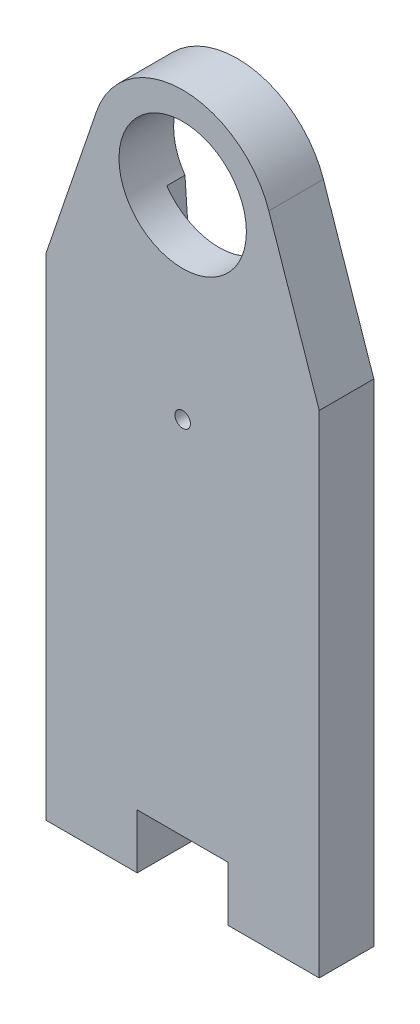
ISO-10303-21;
HEADER;
FILE_DESCRIPTION(('STEP AP214'),'2;1');
FILE_NAME('part.step','',(''),(''),'','','');
FILE_SCHEMA(('AUTOMOTIVE_DESIGN { 1 0 10303 214 1 1 1 1 }'));
ENDSEC;
DATA;
#1=APPLICATION_CONTEXT('core data for automotive mechanical design processes');
#2=APPLICATION_PROTOCOL_DEFINITION('international standard','automotive_design',2000,#1);
#3=PRODUCT_CONTEXT('',#1,'mechanical');
#4=PRODUCT('Part','Part','',(#3));
#5=PRODUCT_RELATED_PRODUCT_CATEGORY('part','',(#4));
#6=PRODUCT_DEFINITION_FORMATION('','',#4);
#7=PRODUCT_DEFINITION_CONTEXT('part definition',#1,'design');
#8=PRODUCT_DEFINITION('design','',#6,#7);
#9=PRODUCT_DEFINITION_SHAPE('','',#8);
#10=(LENGTH_UNIT() NAMED_UNIT(*) SI_UNIT(.MILLI.,.METRE.));
#11=(NAMED_UNIT(*) PLANE_ANGLE_UNIT() SI_UNIT($,.RADIAN.));
#12=(NAMED_UNIT(*) SI_UNIT($,.STERADIAN.) SOLID_ANGLE_UNIT());
#13=UNCERTAINTY_MEASURE_WITH_UNIT(LENGTH_MEASURE(1.E-05),#10,'distance_accuracy_value','');
#14=(GEOMETRIC_REPRESENTATION_CONTEXT(3) GLOBAL_UNCERTAINTY_ASSIGNED_CONTEXT((#13)) GLOBAL_UNIT_ASSIGNED_CONTEXT((#10,
#11,#12)) REPRESENTATION_CONTEXT('',''));
#15=CARTESIAN_POINT('',(0.,0.,0.));
#16=DIRECTION('',(0.,0.,1.));
#17=DIRECTION('',(1.,0.,0.));
#18=AXIS2_PLACEMENT_3D('',#15,#16,#17);
#19=CARTESIAN_POINT('',(42.9999999999916,45.2499999999958,0.));
#20=DIRECTION('',(0.,0.,1.));
#21=DIRECTION('',(1.,0.,0.));
#22=AXIS2_PLACEMENT_3D('',#19,#20,#21);
#23=PLANE('',#22);
#24=CARTESIAN_POINT('',(42.9999999999916,45.2499999999958,0.));
#25=DIRECTION('',(0.,0.,1.));
#26=DIRECTION('',(1.,0.,0.));
#27=AXIS2_PLACEMENT_3D('',#24,#25,#26);
#28=CIRCLE('',#27,5.00000000001832);
#29=CARTESIAN_POINT('',(47.7322787638814,46.8641678044589,0.));
#30=VERTEX_POINT('',#29);
#31=CARTESIAN_POINT('',(38.2677212360993,46.864167804486,0.));
#32=VERTEX_POINT('',#31);
#33=EDGE_CURVE('E155',#30,#32,#28,.T.);
#34=ORIENTED_EDGE('',*,*,#33,.F.);
#35=DIRECTION('',(-0.322833560893029,0.946455752775124,0.));
#36=VECTOR('',#35,1.);
#37=CARTESIAN_POINT('',(47.7322787638814,46.8641678044589,0.));
#38=LINE('',#37,#36);
#39=CARTESIAN_POINT('',(50.4999999999993,38.7499999999858,0.));
#40=VERTEX_POINT('',#39);
#41=EDGE_CURVE('E96',#40,#30,#38,.T.);
#42=ORIENTED_EDGE('',*,*,#41,.F.);
#43=DIRECTION('',(0.,1.,0.));
#44=VECTOR('',#43,1.);
#45=CARTESIAN_POINT('',(50.4999999999993,38.7499999999858,0.));
#46=LINE('',#45,#44);
#47=CARTESIAN_POINT('',(50.4999999999993,11.7499999999859,0.));
#48=VERTEX_POINT('',#47);
#49=EDGE_CURVE('E172',#48,#40,#46,.T.);
#50=ORIENTED_EDGE('',*,*,#49,.F.);
#51=DIRECTION('',(1.,0.,0.));
#52=VECTOR('',#51,1.);
#53=CARTESIAN_POINT('',(50.4999999999993,11.7499999999859,0.));
#54=LINE('',#53,#52);
#55=CARTESIAN_POINT('',(45.4999999999984,11.7499999999858,0.));
#56=VERTEX_POINT('',#55);
#57=EDGE_CURVE('E144',#56,#48,#54,.T.);
#58=ORIENTED_EDGE('',*,*,#57,.F.);
#59=DIRECTION('',(0.,-1.,0.));
#60=VECTOR('',#59,1.);
#61=CARTESIAN_POINT('',(45.4999999999984,11.7499999999858,0.));
#62=LINE('',#61,#60);
#63=CARTESIAN_POINT('',(45.4999999999984,14.7499999999858,0.));
#64=VERTEX_POINT('',#63);
#65=EDGE_CURVE('E169',#64,#56,#62,.T.);
#66=ORIENTED_EDGE('',*,*,#65,.F.);
#67=DIRECTION('',(1.,0.,0.));
#68=VECTOR('',#67,1.);
#69=CARTESIAN_POINT('',(45.4999999999984,14.7499999999858,0.));
#70=LINE('',#69,#68);
#71=CARTESIAN_POINT('',(40.4999999999993,14.7499999999858,0.));
#72=VERTEX_POINT('',#71);
#73=EDGE_CURVE('E167',#72,#64,#70,.T.);
#74=ORIENTED_EDGE('',*,*,#73,.F.);
#75=DIRECTION('',(0.,1.,0.));
#76=VECTOR('',#75,1.);
#77=CARTESIAN_POINT('',(40.4999999999993,14.7499999999858,0.));
#78=LINE('',#77,#76);
#79=CARTESIAN_POINT('',(40.4999999999993,11.7499999999858,0.));
#80=VERTEX_POINT('',#79);
#81=EDGE_CURVE('E165',#80,#72,#78,.T.);
#82=ORIENTED_EDGE('',*,*,#81,.F.);
#83=DIRECTION('',(1.,0.,0.));
#84=VECTOR('',#83,1.);
#85=CARTESIAN_POINT('',(40.4999999999993,11.7499999999858,0.));
#86=LINE('',#85,#84);
#87=CARTESIAN_POINT('',(35.5000000000007,11.7499999999858,0.));
#88=VERTEX_POINT('',#87);
#89=EDGE_CURVE('E163',#88,#80,#86,.T.);
#90=ORIENTED_EDGE('',*,*,#89,.F.);
#91=DIRECTION('',(0.,-1.,0.));
#92=VECTOR('',#91,1.);
#93=CARTESIAN_POINT('',(35.5000000000007,11.7499999999858,0.));
#94=LINE('',#93,#92);
#95=CARTESIAN_POINT('',(35.5000000000007,38.7499999999858,0.));
#96=VERTEX_POINT('',#95);
#97=EDGE_CURVE('E161',#96,#88,#94,.T.);
#98=ORIENTED_EDGE('',*,*,#97,.F.);
#99=DIRECTION('',(-0.322833560890054,-0.946455752776139,0.));
#100=VECTOR('',#99,1.);
#101=CARTESIAN_POINT('',(35.5000000000007,38.7499999999858,0.));
#102=LINE('',#101,#100);
#103=EDGE_CURVE('E158',#32,#96,#102,.T.);
#104=ORIENTED_EDGE('',*,*,#103,.F.);
#105=EDGE_LOOP('',(#34,#42,#50,#58,#66,#74,#82,#90,#98,#104));
#106=FACE_BOUND('',#105,.T.);
#107=DIRECTION('',(0.0694233825828912,-0.997587286381873,0.));
#108=VECTOR('',#107,1.);
#109=CARTESIAN_POINT('',(41.0048254272376,30.611153234821,0.));
#110=LINE('',#109,#108);
#111=CARTESIAN_POINT('',(40.1249999999984,43.2539059759649,0.));
#112=VERTEX_POINT('',#111);
#113=CARTESIAN_POINT('',(41.0048254272376,30.611153234821,0.));
#114=VERTEX_POINT('',#113);
#115=EDGE_CURVE('E251',#112,#114,#110,.T.);
#116=ORIENTED_EDGE('',*,*,#115,.T.);
#117=CARTESIAN_POINT('',(43.0000000000005,30.749999999986,0.));
#118=DIRECTION('',(0.,0.,1.));
#119=DIRECTION('',(1.,0.,0.));
#120=AXIS2_PLACEMENT_3D('',#117,#118,#119);
#121=CIRCLE('',#120,1.99999999999904);
#122=CARTESIAN_POINT('',(44.9951745727633,30.611153234821,0.));
#123=VERTEX_POINT('',#122);
#124=EDGE_CURVE('E248',#114,#123,#121,.T.);
#125=ORIENTED_EDGE('',*,*,#124,.T.);
#126=DIRECTION('',(0.0694233825828588,0.997587286381876,0.));
#127=VECTOR('',#126,1.);
#128=CARTESIAN_POINT('',(45.8750000000033,43.2539059759825,0.));
#129=LINE('',#128,#127);
#130=CARTESIAN_POINT('',(45.8750000000033,43.2539059759825,0.));
#131=VERTEX_POINT('',#130);
#132=EDGE_CURVE('E244',#123,#131,#129,.T.);
#133=ORIENTED_EDGE('',*,*,#132,.T.);
#134=CARTESIAN_POINT('',(42.9999999999916,45.2499999999958,0.));
#135=DIRECTION('',(0.,0.,1.));
#136=DIRECTION('',(1.,0.,0.));
#137=AXIS2_PLACEMENT_3D('',#134,#135,#136);
#138=CIRCLE('',#137,3.50000233610408);
#139=EDGE_CURVE('E225',#131,#112,#138,.T.);
#140=ORIENTED_EDGE('',*,*,#139,.T.);
#141=EDGE_LOOP('',(#116,#125,#133,#140));
#142=FACE_BOUND('',#141,.T.);
#143=ADVANCED_FACE('F33',(#106,#142),#23,.F.);
#144=CARTESIAN_POINT('',(42.9999999999916,45.2499999999958,3.));
#145=DIRECTION('',(0.,0.,-1.));
#146=DIRECTION('',(-1.,0.,0.));
#147=AXIS2_PLACEMENT_3D('',#144,#145,#146);
#148=CYLINDRICAL_SURFACE('',#147,3.50000233610408);
#149=CARTESIAN_POINT('',(42.9999999999916,45.2499999999958,3.));
#150=DIRECTION('',(0.,0.,1.));
#151=DIRECTION('',(1.,0.,0.));
#152=AXIS2_PLACEMENT_3D('',#149,#150,#151);
#153=CIRCLE('',#152,3.50000233610408);
#154=CARTESIAN_POINT('',(46.5000023360957,45.2499999999958,3.));
#155=VERTEX_POINT('',#154);
#156=EDGE_CURVE('E224',#155,#155,#153,.T.);
#157=ORIENTED_EDGE('',*,*,#156,.T.);
#158=EDGE_LOOP('',(#157));
#159=FACE_BOUND('',#158,.T.);
#160=CARTESIAN_POINT('',(42.9999999999948,45.2499999999957,1.));
#161=DIRECTION('',(0.,0.,-1.));
#162=DIRECTION('',(1.,0.,0.));
#163=AXIS2_PLACEMENT_3D('',#160,#161,#162);
#164=CIRCLE('',#163,3.50000233610638);
#165=CARTESIAN_POINT('',(45.8750000000033,43.2539059759825,1.));
#166=VERTEX_POINT('',#165);
#167=CARTESIAN_POINT('',(40.1249999999983,43.2539059759648,1.));
#168=VERTEX_POINT('',#167);
#169=EDGE_CURVE('E247',#166,#168,#164,.T.);
#170=ORIENTED_EDGE('',*,*,#169,.T.);
#171=DIRECTION('',(0.,0.,-1.));
#172=VECTOR('',#171,1.);
#173=CARTESIAN_POINT('',(40.1249999999984,43.2539059759649,1.));
#174=LINE('',#173,#172);
#175=EDGE_CURVE('E48',#168,#112,#174,.T.);
#176=ORIENTED_EDGE('',*,*,#175,.T.);
#177=ORIENTED_EDGE('',*,*,#139,.F.);
#178=DIRECTION('',(0.,0.,-1.));
#179=VECTOR('',#178,1.);
#180=CARTESIAN_POINT('',(45.8750000000033,43.2539059759825,1.));
#181=LINE('',#180,#179);
#182=EDGE_CURVE('E240',#166,#131,#181,.T.);
#183=ORIENTED_EDGE('',*,*,#182,.F.);
#184=EDGE_LOOP('',(#170,#176,#177,#183));
#185=FACE_BOUND('',#184,.T.);
#186=ADVANCED_FACE('F265',(#159,#185),#148,.F.);
#187=CARTESIAN_POINT('',(42.9999999999916,45.2499999999958,3.));
#188=DIRECTION('',(0.,0.,1.));
#189=DIRECTION('',(1.,0.,0.));
#190=AXIS2_PLACEMENT_3D('',#187,#188,#189);
#191=PLANE('',#190);
#192=CARTESIAN_POINT('',(42.9999999999993,34.5777705464858,3.));
#193=DIRECTION('',(0.,0.,1.));
#194=DIRECTION('',(1.,0.,0.));
#195=AXIS2_PLACEMENT_3D('',#192,#193,#194);
#196=CIRCLE('',#195,0.425000000000002);
#197=CARTESIAN_POINT('',(43.4249999999993,34.5777705464858,3.));
#198=VERTEX_POINT('',#197);
#199=EDGE_CURVE('E159',#198,#198,#196,.T.);
#200=ORIENTED_EDGE('',*,*,#199,.F.);
#201=EDGE_LOOP('',(#200));
#202=FACE_BOUND('',#201,.T.);
#203=CARTESIAN_POINT('',(42.9999999999916,45.2499999999958,3.));
#204=DIRECTION('',(0.,0.,1.));
#205=DIRECTION('',(1.,0.,0.));
#206=AXIS2_PLACEMENT_3D('',#203,#204,#205);
#207=CIRCLE('',#206,5.00000000001832);
#208=CARTESIAN_POINT('',(47.7322787638814,46.8641678044589,3.));
#209=VERTEX_POINT('',#208);
#210=CARTESIAN_POINT('',(38.2677212360993,46.864167804486,3.));
#211=VERTEX_POINT('',#210);
#212=EDGE_CURVE('E175',#209,#211,#207,.T.);
#213=ORIENTED_EDGE('',*,*,#212,.T.);
#214=DIRECTION('',(-0.322833560890054,-0.946455752776139,0.));
#215=VECTOR('',#214,1.);
#216=CARTESIAN_POINT('',(35.5000000000007,38.7499999999858,3.));
#217=LINE('',#216,#215);
#218=CARTESIAN_POINT('',(35.5000000000007,38.7499999999858,3.));
#219=VERTEX_POINT('',#218);
#220=EDGE_CURVE('E104',#211,#219,#217,.T.);
#221=ORIENTED_EDGE('',*,*,#220,.T.);
#222=DIRECTION('',(0.,-1.,0.));
#223=VECTOR('',#222,1.);
#224=CARTESIAN_POINT('',(35.5000000000007,11.7499999999858,3.));
#225=LINE('',#224,#223);
#226=CARTESIAN_POINT('',(35.5000000000007,11.7499999999858,3.));
#227=VERTEX_POINT('',#226);
#228=EDGE_CURVE('E196',#219,#227,#225,.T.);
#229=ORIENTED_EDGE('',*,*,#228,.T.);
#230=DIRECTION('',(1.,0.,0.));
#231=VECTOR('',#230,1.);
#232=CARTESIAN_POINT('',(40.4999999999993,11.7499999999858,3.));
#233=LINE('',#232,#231);
#234=CARTESIAN_POINT('',(40.4999999999993,11.7499999999858,3.));
#235=VERTEX_POINT('',#234);
#236=EDGE_CURVE('E214',#227,#235,#233,.T.);
#237=ORIENTED_EDGE('',*,*,#236,.T.);
#238=DIRECTION('',(0.,1.,0.));
#239=VECTOR('',#238,1.);
#240=CARTESIAN_POINT('',(40.4999999999993,14.7499999999858,3.));
#241=LINE('',#240,#239);
#242=CARTESIAN_POINT('',(40.4999999999993,14.7499999999858,3.));
#243=VERTEX_POINT('',#242);
#244=EDGE_CURVE('E211',#235,#243,#241,.T.);
#245=ORIENTED_EDGE('',*,*,#244,.T.);
#246=DIRECTION('',(1.,0.,0.));
#247=VECTOR('',#246,1.);
#248=CARTESIAN_POINT('',(45.4999999999984,14.7499999999858,3.));
#249=LINE('',#248,#247);
#250=CARTESIAN_POINT('',(45.4999999999984,14.7499999999858,3.));
#251=VERTEX_POINT('',#250);
#252=EDGE_CURVE('E213',#243,#251,#249,.T.);
#253=ORIENTED_EDGE('',*,*,#252,.T.);
#254=DIRECTION('',(0.,-1.,0.));
#255=VECTOR('',#254,1.);
#256=CARTESIAN_POINT('',(45.4999999999984,11.7499999999858,3.));
#257=LINE('',#256,#255);
#258=CARTESIAN_POINT('',(45.4999999999984,11.7499999999858,3.));
#259=VERTEX_POINT('',#258);
#260=EDGE_CURVE('E134',#251,#259,#257,.T.);
#261=ORIENTED_EDGE('',*,*,#260,.T.);
#262=DIRECTION('',(1.,0.,0.));
#263=VECTOR('',#262,1.);
#264=CARTESIAN_POINT('',(50.4999999999993,11.7499999999859,3.));
#265=LINE('',#264,#263);
#266=CARTESIAN_POINT('',(50.4999999999993,11.7499999999859,3.));
#267=VERTEX_POINT('',#266);
#268=EDGE_CURVE('E126',#259,#267,#265,.T.);
#269=ORIENTED_EDGE('',*,*,#268,.T.);
#270=DIRECTION('',(0.,1.,0.));
#271=VECTOR('',#270,1.);
#272=CARTESIAN_POINT('',(50.4999999999993,24.7499999999859,3.));
#273=LINE('',#272,#271);
#274=CARTESIAN_POINT('',(50.4999999999993,38.7499999999858,3.));
#275=VERTEX_POINT('',#274);
#276=EDGE_CURVE('E131',#267,#275,#273,.T.);
#277=ORIENTED_EDGE('',*,*,#276,.T.);
#278=DIRECTION('',(-0.322833560893029,0.946455752775124,0.));
#279=VECTOR('',#278,1.);
#280=CARTESIAN_POINT('',(47.7322787638814,46.8641678044589,3.));
#281=LINE('',#280,#279);
#282=EDGE_CURVE('E57',#275,#209,#281,.T.);
#283=ORIENTED_EDGE('',*,*,#282,.T.);
#284=EDGE_LOOP('',(#213,#221,#229,#237,#245,#253,#261,#269,#277,#283));
#285=FACE_BOUND('',#284,.T.);
#286=ORIENTED_EDGE('',*,*,#156,.F.);
#287=EDGE_LOOP('',(#286));
#288=FACE_BOUND('',#287,.T.);
#289=ADVANCED_FACE('F128',(#202,#285,#288),#191,.T.);
#290=CARTESIAN_POINT('',(42.9999999999916,45.2499999999958,3.));
#291=DIRECTION('',(0.,0.,-1.));
#292=DIRECTION('',(-1.,0.,0.));
#293=AXIS2_PLACEMENT_3D('',#290,#291,#292);
#294=CYLINDRICAL_SURFACE('',#293,5.00000000001832);
#295=ORIENTED_EDGE('',*,*,#33,.T.);
#296=DIRECTION('',(0.,0.,-1.));
#297=VECTOR('',#296,1.);
#298=CARTESIAN_POINT('',(38.2677212360993,46.864167804486,3.));
#299=LINE('',#298,#297);
#300=EDGE_CURVE('E11',#211,#32,#299,.T.);
#301=ORIENTED_EDGE('',*,*,#300,.F.);
#302=ORIENTED_EDGE('',*,*,#212,.F.);
#303=DIRECTION('',(0.,0.,-1.));
#304=VECTOR('',#303,1.);
#305=CARTESIAN_POINT('',(47.7322787638814,46.8641678044589,3.));
#306=LINE('',#305,#304);
#307=EDGE_CURVE('E151',#209,#30,#306,.T.);
#308=ORIENTED_EDGE('',*,*,#307,.T.);
#309=EDGE_LOOP('',(#295,#301,#302,#308));
#310=FACE_BOUND('',#309,.T.);
#311=ADVANCED_FACE('F35',(#310),#294,.T.);
#312=CARTESIAN_POINT('',(35.5000000000007,38.7499999999858,3.));
#313=DIRECTION('',(0.946455752776139,-0.322833560890054,0.));
#314=DIRECTION('',(0.322833560890054,0.946455752776139,0.));
#315=AXIS2_PLACEMENT_3D('',#312,#313,#314);
#316=PLANE('',#315);
#317=ORIENTED_EDGE('',*,*,#103,.T.);
#318=DIRECTION('',(0.,0.,-1.));
#319=VECTOR('',#318,1.);
#320=CARTESIAN_POINT('',(35.5000000000007,38.7499999999858,3.));
#321=LINE('',#320,#319);
#322=EDGE_CURVE('E41',#219,#96,#321,.T.);
#323=ORIENTED_EDGE('',*,*,#322,.F.);
#324=ORIENTED_EDGE('',*,*,#220,.F.);
#325=ORIENTED_EDGE('',*,*,#300,.T.);
#326=EDGE_LOOP('',(#317,#323,#324,#325));
#327=FACE_BOUND('',#326,.T.);
#328=ADVANCED_FACE('F330',(#327),#316,.F.);
#329=CARTESIAN_POINT('',(35.5000000000007,11.7499999999858,3.));
#330=DIRECTION('',(1.,0.,0.));
#331=DIRECTION('',(0.,0.,-1.));
#332=AXIS2_PLACEMENT_3D('',#329,#330,#331);
#333=PLANE('',#332);
#334=ORIENTED_EDGE('',*,*,#97,.T.);
#335=DIRECTION('',(0.,0.,-1.));
#336=VECTOR('',#335,1.);
#337=CARTESIAN_POINT('',(35.5000000000007,11.7499999999858,3.));
#338=LINE('',#337,#336);
#339=EDGE_CURVE('E188',#227,#88,#338,.T.);
#340=ORIENTED_EDGE('',*,*,#339,.F.);
#341=ORIENTED_EDGE('',*,*,#228,.F.);
#342=ORIENTED_EDGE('',*,*,#322,.T.);
#343=EDGE_LOOP('',(#334,#340,#341,#342));
#344=FACE_BOUND('',#343,.T.);
#345=ADVANCED_FACE('F194',(#344),#333,.F.);
#346=CARTESIAN_POINT('',(40.4999999999993,11.7499999999858,3.));
#347=DIRECTION('',(0.,1.,0.));
#348=DIRECTION('',(0.,0.,1.));
#349=AXIS2_PLACEMENT_3D('',#346,#347,#348);
#350=PLANE('',#349);
#351=ORIENTED_EDGE('',*,*,#89,.T.);
#352=DIRECTION('',(0.,0.,-1.));
#353=VECTOR('',#352,1.);
#354=CARTESIAN_POINT('',(40.4999999999993,11.7499999999858,3.));
#355=LINE('',#354,#353);
#356=EDGE_CURVE('E185',#235,#80,#355,.T.);
#357=ORIENTED_EDGE('',*,*,#356,.F.);
#358=ORIENTED_EDGE('',*,*,#236,.F.);
#359=ORIENTED_EDGE('',*,*,#339,.T.);
#360=EDGE_LOOP('',(#351,#357,#358,#359));
#361=FACE_BOUND('',#360,.T.);
#362=ADVANCED_FACE('F205',(#361),#350,.F.);
#363=CARTESIAN_POINT('',(40.4999999999993,14.7499999999858,3.));
#364=DIRECTION('',(-1.,0.,0.));
#365=DIRECTION('',(0.,0.,1.));
#366=AXIS2_PLACEMENT_3D('',#363,#364,#365);
#367=PLANE('',#366);
#368=ORIENTED_EDGE('',*,*,#81,.T.);
#369=DIRECTION('',(0.,0.,-1.));
#370=VECTOR('',#369,1.);
#371=CARTESIAN_POINT('',(40.4999999999993,14.7499999999858,3.));
#372=LINE('',#371,#370);
#373=EDGE_CURVE('E182',#243,#72,#372,.T.);
#374=ORIENTED_EDGE('',*,*,#373,.F.);
#375=ORIENTED_EDGE('',*,*,#244,.F.);
#376=ORIENTED_EDGE('',*,*,#356,.T.);
#377=EDGE_LOOP('',(#368,#374,#375,#376));
#378=FACE_BOUND('',#377,.T.);
#379=ADVANCED_FACE('F209',(#378),#367,.F.);
#380=CARTESIAN_POINT('',(45.4999999999984,14.7499999999858,3.));
#381=DIRECTION('',(0.,1.,0.));
#382=DIRECTION('',(0.,0.,1.));
#383=AXIS2_PLACEMENT_3D('',#380,#381,#382);
#384=PLANE('',#383);
#385=ORIENTED_EDGE('',*,*,#73,.T.);
#386=DIRECTION('',(0.,0.,-1.));
#387=VECTOR('',#386,1.);
#388=CARTESIAN_POINT('',(45.4999999999984,14.7499999999858,3.));
#389=LINE('',#388,#387);
#390=EDGE_CURVE('E179',#251,#64,#389,.T.);
#391=ORIENTED_EDGE('',*,*,#390,.F.);
#392=ORIENTED_EDGE('',*,*,#252,.F.);
#393=ORIENTED_EDGE('',*,*,#373,.T.);
#394=EDGE_LOOP('',(#385,#391,#392,#393));
#395=FACE_BOUND('',#394,.T.);
#396=ADVANCED_FACE('F320',(#395),#384,.F.);
#397=CARTESIAN_POINT('',(45.4999999999984,11.7499999999858,3.));
#398=DIRECTION('',(1.,0.,0.));
#399=DIRECTION('',(0.,0.,-1.));
#400=AXIS2_PLACEMENT_3D('',#397,#398,#399);
#401=PLANE('',#400);
#402=ORIENTED_EDGE('',*,*,#65,.T.);
#403=DIRECTION('',(0.,0.,-1.));
#404=VECTOR('',#403,1.);
#405=CARTESIAN_POINT('',(45.4999999999984,11.7499999999858,3.));
#406=LINE('',#405,#404);
#407=EDGE_CURVE('E146',#259,#56,#406,.T.);
#408=ORIENTED_EDGE('',*,*,#407,.F.);
#409=ORIENTED_EDGE('',*,*,#260,.F.);
#410=ORIENTED_EDGE('',*,*,#390,.T.);
#411=EDGE_LOOP('',(#402,#408,#409,#410));
#412=FACE_BOUND('',#411,.T.);
#413=ADVANCED_FACE('F317',(#412),#401,.F.);
#414=CARTESIAN_POINT('',(50.4999999999993,11.7499999999859,3.));
#415=DIRECTION('',(0.,1.,0.));
#416=DIRECTION('',(-1.,0.,0.));
#417=AXIS2_PLACEMENT_3D('',#414,#415,#416);
#418=PLANE('',#417);
#419=ORIENTED_EDGE('',*,*,#57,.T.);
#420=DIRECTION('',(0.,0.,-1.));
#421=VECTOR('',#420,1.);
#422=CARTESIAN_POINT('',(50.4999999999993,11.7499999999859,3.));
#423=LINE('',#422,#421);
#424=EDGE_CURVE('E141',#267,#48,#423,.T.);
#425=ORIENTED_EDGE('',*,*,#424,.F.);
#426=ORIENTED_EDGE('',*,*,#268,.F.);
#427=ORIENTED_EDGE('',*,*,#407,.T.);
#428=EDGE_LOOP('',(#419,#425,#426,#427));
#429=FACE_BOUND('',#428,.T.);
#430=ADVANCED_FACE('F142',(#429),#418,.F.);
#431=CARTESIAN_POINT('',(50.4999999999993,38.7499999999858,3.));
#432=DIRECTION('',(-1.,0.,0.));
#433=DIRECTION('',(0.,0.,1.));
#434=AXIS2_PLACEMENT_3D('',#431,#432,#433);
#435=PLANE('',#434);
#436=ORIENTED_EDGE('',*,*,#49,.T.);
#437=DIRECTION('',(0.,0.,-1.));
#438=VECTOR('',#437,1.);
#439=CARTESIAN_POINT('',(50.4999999999993,38.7499999999858,3.));
#440=LINE('',#439,#438);
#441=EDGE_CURVE('E147',#275,#40,#440,.T.);
#442=ORIENTED_EDGE('',*,*,#441,.F.);
#443=ORIENTED_EDGE('',*,*,#276,.F.);
#444=ORIENTED_EDGE('',*,*,#424,.T.);
#445=EDGE_LOOP('',(#436,#442,#443,#444));
#446=FACE_BOUND('',#445,.T.);
#447=ADVANCED_FACE('F149',(#446),#435,.F.);
#448=CARTESIAN_POINT('',(47.7322787638814,46.8641678044589,3.));
#449=DIRECTION('',(-0.946455752775124,-0.322833560893029,0.));
#450=DIRECTION('',(0.322833560893029,-0.946455752775124,0.));
#451=AXIS2_PLACEMENT_3D('',#448,#449,#450);
#452=PLANE('',#451);
#453=ORIENTED_EDGE('',*,*,#41,.T.);
#454=ORIENTED_EDGE('',*,*,#307,.F.);
#455=ORIENTED_EDGE('',*,*,#282,.F.);
#456=ORIENTED_EDGE('',*,*,#441,.T.);
#457=EDGE_LOOP('',(#453,#454,#455,#456));
#458=FACE_BOUND('',#457,.T.);
#459=ADVANCED_FACE('F309',(#458),#452,.F.);
#460=CARTESIAN_POINT('',(42.9999999999993,34.5777705464858,3.));
#461=DIRECTION('',(0.,0.,-1.));
#462=DIRECTION('',(-1.,0.,0.));
#463=AXIS2_PLACEMENT_3D('',#460,#461,#462);
#464=CYLINDRICAL_SURFACE('',#463,0.425000000000002);
#465=CARTESIAN_POINT('',(42.9999999999993,34.5777705464858,1.));
#466=DIRECTION('',(0.,0.,1.));
#467=DIRECTION('',(1.,0.,0.));
#468=AXIS2_PLACEMENT_3D('',#465,#466,#467);
#469=CIRCLE('',#468,0.425000000000002);
#470=CARTESIAN_POINT('',(43.4249999999993,34.5777705464858,1.));
#471=VERTEX_POINT('',#470);
#472=EDGE_CURVE('E228',#471,#471,#469,.T.);
#473=ORIENTED_EDGE('',*,*,#472,.F.);
#474=EDGE_LOOP('',(#473));
#475=FACE_BOUND('',#474,.T.);
#476=ORIENTED_EDGE('',*,*,#199,.T.);
#477=EDGE_LOOP('',(#476));
#478=FACE_BOUND('',#477,.T.);
#479=ADVANCED_FACE('F312',(#475,#478),#464,.F.);
#480=CARTESIAN_POINT('',(41.0048254272376,30.611153234821,1.));
#481=DIRECTION('',(0.997587286381873,0.0694233825828912,0.));
#482=DIRECTION('',(-0.0694233825828912,0.997587286381873,0.));
#483=AXIS2_PLACEMENT_3D('',#480,#481,#482);
#484=PLANE('',#483);
#485=ORIENTED_EDGE('',*,*,#115,.F.);
#486=ORIENTED_EDGE('',*,*,#175,.F.);
#487=DIRECTION('',(0.0694233825828912,-0.997587286381873,0.));
#488=VECTOR('',#487,1.);
#489=CARTESIAN_POINT('',(41.0048254272376,30.611153234821,1.));
#490=LINE('',#489,#488);
#491=CARTESIAN_POINT('',(41.0048254272376,30.611153234821,1.));
#492=VERTEX_POINT('',#491);
#493=EDGE_CURVE('E259',#168,#492,#490,.T.);
#494=ORIENTED_EDGE('',*,*,#493,.T.);
#495=DIRECTION('',(0.,0.,-1.));
#496=VECTOR('',#495,1.);
#497=CARTESIAN_POINT('',(41.0048254272376,30.611153234821,1.));
#498=LINE('',#497,#496);
#499=EDGE_CURVE('E234',#492,#114,#498,.T.);
#500=ORIENTED_EDGE('',*,*,#499,.T.);
#501=EDGE_LOOP('',(#485,#486,#494,#500));
#502=FACE_BOUND('',#501,.T.);
#503=ADVANCED_FACE('F287',(#502),#484,.T.);
#504=CARTESIAN_POINT('',(43.0000000000005,30.749999999986,1.));
#505=DIRECTION('',(0.,0.,-1.));
#506=DIRECTION('',(-1.,0.,0.));
#507=AXIS2_PLACEMENT_3D('',#504,#505,#506);
#508=CYLINDRICAL_SURFACE('',#507,1.99999999999904);
#509=ORIENTED_EDGE('',*,*,#124,.F.);
#510=ORIENTED_EDGE('',*,*,#499,.F.);
#511=CARTESIAN_POINT('',(43.0000000000005,30.749999999986,1.));
#512=DIRECTION('',(0.,0.,1.));
#513=DIRECTION('',(1.,0.,0.));
#514=AXIS2_PLACEMENT_3D('',#511,#512,#513);
#515=CIRCLE('',#514,1.99999999999904);
#516=CARTESIAN_POINT('',(44.9951745727633,30.611153234821,1.));
#517=VERTEX_POINT('',#516);
#518=EDGE_CURVE('E256',#492,#517,#515,.T.);
#519=ORIENTED_EDGE('',*,*,#518,.T.);
#520=DIRECTION('',(0.,0.,-1.));
#521=VECTOR('',#520,1.);
#522=CARTESIAN_POINT('',(44.9951745727633,30.611153234821,1.));
#523=LINE('',#522,#521);
#524=EDGE_CURVE('E237',#517,#123,#523,.T.);
#525=ORIENTED_EDGE('',*,*,#524,.T.);
#526=EDGE_LOOP('',(#509,#510,#519,#525));
#527=FACE_BOUND('',#526,.T.);
#528=ADVANCED_FACE('F288',(#527),#508,.F.);
#529=CARTESIAN_POINT('',(45.8750000000033,43.2539059759825,1.));
#530=DIRECTION('',(-0.997587286381876,0.0694233825828588,0.));
#531=DIRECTION('',(-0.0694233825828588,-0.997587286381876,0.));
#532=AXIS2_PLACEMENT_3D('',#529,#530,#531);
#533=PLANE('',#532);
#534=ORIENTED_EDGE('',*,*,#132,.F.);
#535=ORIENTED_EDGE('',*,*,#524,.F.);
#536=DIRECTION('',(0.0694233825828588,0.997587286381876,0.));
#537=VECTOR('',#536,1.);
#538=CARTESIAN_POINT('',(45.8750000000033,43.2539059759825,1.));
#539=LINE('',#538,#537);
#540=EDGE_CURVE('E243',#517,#166,#539,.T.);
#541=ORIENTED_EDGE('',*,*,#540,.T.);
#542=ORIENTED_EDGE('',*,*,#182,.T.);
#543=EDGE_LOOP('',(#534,#535,#541,#542));
#544=FACE_BOUND('',#543,.T.);
#545=ADVANCED_FACE('F289',(#544),#533,.T.);
#546=CARTESIAN_POINT('',(42.9999999999948,45.2499999999957,1.));
#547=DIRECTION('',(0.,0.,1.));
#548=DIRECTION('',(1.,0.,0.));
#549=AXIS2_PLACEMENT_3D('',#546,#547,#548);
#550=PLANE('',#549);
#551=ORIENTED_EDGE('',*,*,#472,.T.);
#552=EDGE_LOOP('',(#551));
#553=FACE_BOUND('',#552,.T.);
#554=ORIENTED_EDGE('',*,*,#169,.F.);
#555=ORIENTED_EDGE('',*,*,#540,.F.);
#556=ORIENTED_EDGE('',*,*,#518,.F.);
#557=ORIENTED_EDGE('',*,*,#493,.F.);
#558=EDGE_LOOP('',(#554,#555,#556,#557));
#559=FACE_BOUND('',#558,.T.);
#560=ADVANCED_FACE('F270',(#553,#559),#550,.F.);
#561=CLOSED_SHELL('',(#143,#186,#289,#311,#328,#345,#362,#379,#396,#413,#430,#447,#459,#479,
#503,#528,#545,#560));
#562=MANIFOLD_SOLID_BREP('B2',#561);
#563=ADVANCED_BREP_SHAPE_REPRESENTATION('',(#18,#562),#14);
#564=SHAPE_DEFINITION_REPRESENTATION(#9,#563);
ENDSEC;
END-ISO-10303-21;
